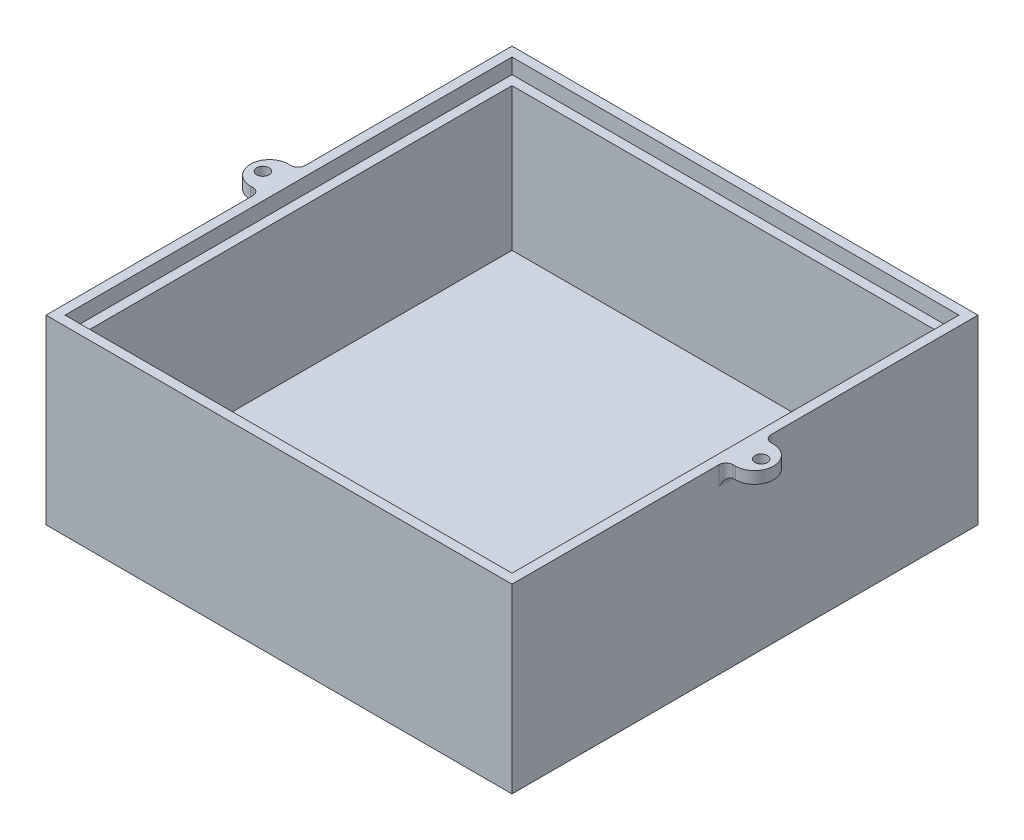
ISO-10303-21;
HEADER;
FILE_DESCRIPTION(('STEP AP214'),'2;1');
FILE_NAME('part.step','',(''),(''),'','','');
FILE_SCHEMA(('AUTOMOTIVE_DESIGN { 1 0 10303 214 1 1 1 1 }'));
ENDSEC;
DATA;
#1=APPLICATION_CONTEXT('core data for automotive mechanical design processes');
#2=APPLICATION_PROTOCOL_DEFINITION('international standard','automotive_design',2000,#1);
#3=PRODUCT_CONTEXT('',#1,'mechanical');
#4=PRODUCT('Part','Part','',(#3));
#5=PRODUCT_RELATED_PRODUCT_CATEGORY('part','',(#4));
#6=PRODUCT_DEFINITION_FORMATION('','',#4);
#7=PRODUCT_DEFINITION_CONTEXT('part definition',#1,'design');
#8=PRODUCT_DEFINITION('design','',#6,#7);
#9=PRODUCT_DEFINITION_SHAPE('','',#8);
#10=(LENGTH_UNIT() NAMED_UNIT(*) SI_UNIT(.MILLI.,.METRE.));
#11=(NAMED_UNIT(*) PLANE_ANGLE_UNIT() SI_UNIT($,.RADIAN.));
#12=(NAMED_UNIT(*) SI_UNIT($,.STERADIAN.) SOLID_ANGLE_UNIT());
#13=UNCERTAINTY_MEASURE_WITH_UNIT(LENGTH_MEASURE(1.E-05),#10,'distance_accuracy_value','');
#14=(GEOMETRIC_REPRESENTATION_CONTEXT(3) GLOBAL_UNCERTAINTY_ASSIGNED_CONTEXT((#13)) GLOBAL_UNIT_ASSIGNED_CONTEXT((#10,
#11,#12)) REPRESENTATION_CONTEXT('',''));
#15=CARTESIAN_POINT('',(0.,0.,0.));
#16=DIRECTION('',(0.,0.,1.));
#17=DIRECTION('',(1.,0.,0.));
#18=AXIS2_PLACEMENT_3D('',#15,#16,#17);
#19=CARTESIAN_POINT('',(49.,40.,-49.));
#20=DIRECTION('',(-1.,0.,0.));
#21=DIRECTION('',(0.,0.,1.));
#22=AXIS2_PLACEMENT_3D('',#19,#20,#21);
#23=PLANE('',#22);
#24=DIRECTION('',(0.,0.,-1.));
#25=VECTOR('',#24,1.);
#26=CARTESIAN_POINT('',(49.,38.2,-49.));
#27=LINE('',#26,#25);
#28=CARTESIAN_POINT('',(49.,38.2,-5.50000000000001));
#29=VERTEX_POINT('',#28);
#30=CARTESIAN_POINT('',(49.,38.2,-49.));
#31=VERTEX_POINT('',#30);
#32=EDGE_CURVE('E300',#29,#31,#27,.T.);
#33=ORIENTED_EDGE('',*,*,#32,.F.);
#34=DIRECTION('',(0.,1.,0.));
#35=VECTOR('',#34,1.);
#36=CARTESIAN_POINT('',(49.,40.,-5.50000000000001));
#37=LINE('',#36,#35);
#38=CARTESIAN_POINT('',(49.,34.2,-5.5));
#39=VERTEX_POINT('',#38);
#40=EDGE_CURVE('E455',#29,#39,#37,.F.);
#41=ORIENTED_EDGE('',*,*,#40,.T.);
#42=DIRECTION('',(0.,0.,1.));
#43=VECTOR('',#42,1.);
#44=CARTESIAN_POINT('',(49.,34.2,-49.));
#45=LINE('',#44,#43);
#46=CARTESIAN_POINT('',(49.,34.2,5.5));
#47=VERTEX_POINT('',#46);
#48=EDGE_CURVE('E452',#39,#47,#45,.T.);
#49=ORIENTED_EDGE('',*,*,#48,.T.);
#50=DIRECTION('',(0.,1.,0.));
#51=VECTOR('',#50,1.);
#52=CARTESIAN_POINT('',(49.,40.,5.5));
#53=LINE('',#52,#51);
#54=CARTESIAN_POINT('',(49.,38.2,5.5));
#55=VERTEX_POINT('',#54);
#56=EDGE_CURVE('E449',#47,#55,#53,.T.);
#57=ORIENTED_EDGE('',*,*,#56,.T.);
#58=CARTESIAN_POINT('',(49.,38.2,49.));
#59=VERTEX_POINT('',#58);
#60=EDGE_CURVE('E301',#59,#55,#27,.T.);
#61=ORIENTED_EDGE('',*,*,#60,.F.);
#62=DIRECTION('',(0.,-1.,0.));
#63=VECTOR('',#62,1.);
#64=CARTESIAN_POINT('',(49.,40.,49.));
#65=LINE('',#64,#63);
#66=CARTESIAN_POINT('',(49.,0.,49.));
#67=VERTEX_POINT('',#66);
#68=EDGE_CURVE('E399',#59,#67,#65,.T.);
#69=ORIENTED_EDGE('',*,*,#68,.T.);
#70=DIRECTION('',(0.,0.,-1.));
#71=VECTOR('',#70,1.);
#72=CARTESIAN_POINT('',(49.,0.,-49.));
#73=LINE('',#72,#71);
#74=CARTESIAN_POINT('',(49.,0.,-49.));
#75=VERTEX_POINT('',#74);
#76=EDGE_CURVE('E372',#67,#75,#73,.T.);
#77=ORIENTED_EDGE('',*,*,#76,.T.);
#78=DIRECTION('',(0.,-1.,0.));
#79=VECTOR('',#78,1.);
#80=CARTESIAN_POINT('',(49.,40.,-49.));
#81=LINE('',#80,#79);
#82=EDGE_CURVE('E408',#31,#75,#81,.T.);
#83=ORIENTED_EDGE('',*,*,#82,.F.);
#84=EDGE_LOOP('',(#33,#41,#49,#57,#61,#69,#77,#83));
#85=FACE_BOUND('',#84,.T.);
#86=ADVANCED_FACE('F39',(#85),#23,.F.);
#87=CARTESIAN_POINT('',(-49.,40.,-49.));
#88=DIRECTION('',(1.,0.,0.));
#89=DIRECTION('',(0.,0.,-1.));
#90=AXIS2_PLACEMENT_3D('',#87,#88,#89);
#91=PLANE('',#90);
#92=DIRECTION('',(0.,0.,-1.));
#93=VECTOR('',#92,1.);
#94=CARTESIAN_POINT('',(-49.,34.2,-4.));
#95=LINE('',#94,#93);
#96=CARTESIAN_POINT('',(-49.,34.2,5.5));
#97=VERTEX_POINT('',#96);
#98=CARTESIAN_POINT('',(-49.,34.2,-5.50000000000001));
#99=VERTEX_POINT('',#98);
#100=EDGE_CURVE('E414',#97,#99,#95,.T.);
#101=ORIENTED_EDGE('',*,*,#100,.T.);
#102=DIRECTION('',(0.,1.,0.));
#103=VECTOR('',#102,1.);
#104=CARTESIAN_POINT('',(-49.,40.,-5.50000000000001));
#105=LINE('',#104,#103);
#106=CARTESIAN_POINT('',(-49.,38.2,-5.50000000000001));
#107=VERTEX_POINT('',#106);
#108=EDGE_CURVE('E417',#99,#107,#105,.T.);
#109=ORIENTED_EDGE('',*,*,#108,.T.);
#110=DIRECTION('',(0.,0.,1.));
#111=VECTOR('',#110,1.);
#112=CARTESIAN_POINT('',(-49.,38.2,-49.));
#113=LINE('',#112,#111);
#114=CARTESIAN_POINT('',(-49.,38.2,-49.));
#115=VERTEX_POINT('',#114);
#116=EDGE_CURVE('E293',#115,#107,#113,.T.);
#117=ORIENTED_EDGE('',*,*,#116,.F.);
#118=DIRECTION('',(0.,-1.,0.));
#119=VECTOR('',#118,1.);
#120=CARTESIAN_POINT('',(-49.,40.,-49.));
#121=LINE('',#120,#119);
#122=CARTESIAN_POINT('',(-49.,0.,-49.));
#123=VERTEX_POINT('',#122);
#124=EDGE_CURVE('E405',#115,#123,#121,.T.);
#125=ORIENTED_EDGE('',*,*,#124,.T.);
#126=DIRECTION('',(0.,0.,1.));
#127=VECTOR('',#126,1.);
#128=CARTESIAN_POINT('',(-49.,0.,-49.));
#129=LINE('',#128,#127);
#130=CARTESIAN_POINT('',(-49.,0.,49.));
#131=VERTEX_POINT('',#130);
#132=EDGE_CURVE('E391',#123,#131,#129,.T.);
#133=ORIENTED_EDGE('',*,*,#132,.T.);
#134=DIRECTION('',(0.,-1.,0.));
#135=VECTOR('',#134,1.);
#136=CARTESIAN_POINT('',(-49.,40.,49.));
#137=LINE('',#136,#135);
#138=CARTESIAN_POINT('',(-49.,38.2,49.));
#139=VERTEX_POINT('',#138);
#140=EDGE_CURVE('E402',#139,#131,#137,.T.);
#141=ORIENTED_EDGE('',*,*,#140,.F.);
#142=CARTESIAN_POINT('',(-49.,38.2,5.5));
#143=VERTEX_POINT('',#142);
#144=EDGE_CURVE('E292',#143,#139,#113,.T.);
#145=ORIENTED_EDGE('',*,*,#144,.F.);
#146=DIRECTION('',(0.,1.,0.));
#147=VECTOR('',#146,1.);
#148=CARTESIAN_POINT('',(-49.,40.,5.5));
#149=LINE('',#148,#147);
#150=EDGE_CURVE('E411',#143,#97,#149,.F.);
#151=ORIENTED_EDGE('',*,*,#150,.T.);
#152=EDGE_LOOP('',(#101,#109,#117,#125,#133,#141,#145,#151));
#153=FACE_BOUND('',#152,.T.);
#154=ADVANCED_FACE('F491',(#153),#91,.F.);
#155=CARTESIAN_POINT('',(47.,35.,-47.));
#156=DIRECTION('',(1.,0.,0.));
#157=DIRECTION('',(0.,0.,-1.));
#158=AXIS2_PLACEMENT_3D('',#155,#156,#157);
#159=PLANE('',#158);
#160=DIRECTION('',(0.,0.,-1.));
#161=VECTOR('',#160,1.);
#162=CARTESIAN_POINT('',(47.,38.2,-47.));
#163=LINE('',#162,#161);
#164=CARTESIAN_POINT('',(47.,38.2,47.));
#165=VERTEX_POINT('',#164);
#166=CARTESIAN_POINT('',(47.,38.2,-47.));
#167=VERTEX_POINT('',#166);
#168=EDGE_CURVE('E284',#165,#167,#163,.T.);
#169=ORIENTED_EDGE('',*,*,#168,.T.);
#170=DIRECTION('',(0.,1.,0.));
#171=VECTOR('',#170,1.);
#172=CARTESIAN_POINT('',(47.,35.,-47.));
#173=LINE('',#172,#171);
#174=CARTESIAN_POINT('',(47.,35.,-47.));
#175=VERTEX_POINT('',#174);
#176=EDGE_CURVE('E367',#175,#167,#173,.T.);
#177=ORIENTED_EDGE('',*,*,#176,.F.);
#178=DIRECTION('',(0.,0.,-1.));
#179=VECTOR('',#178,1.);
#180=CARTESIAN_POINT('',(47.,35.,-47.));
#181=LINE('',#180,#179);
#182=CARTESIAN_POINT('',(47.,35.,47.));
#183=VERTEX_POINT('',#182);
#184=EDGE_CURVE('E342',#183,#175,#181,.T.);
#185=ORIENTED_EDGE('',*,*,#184,.F.);
#186=DIRECTION('',(0.,1.,0.));
#187=VECTOR('',#186,1.);
#188=CARTESIAN_POINT('',(47.,35.,47.));
#189=LINE('',#188,#187);
#190=EDGE_CURVE('E368',#183,#165,#189,.T.);
#191=ORIENTED_EDGE('',*,*,#190,.T.);
#192=EDGE_LOOP('',(#169,#177,#185,#191));
#193=FACE_BOUND('',#192,.T.);
#194=ADVANCED_FACE('F552',(#193),#159,.F.);
#195=CARTESIAN_POINT('',(-47.,35.,47.));
#196=DIRECTION('',(0.,0.,1.));
#197=DIRECTION('',(1.,0.,0.));
#198=AXIS2_PLACEMENT_3D('',#195,#196,#197);
#199=PLANE('',#198);
#200=DIRECTION('',(1.,0.,0.));
#201=VECTOR('',#200,1.);
#202=CARTESIAN_POINT('',(-47.,38.2,47.));
#203=LINE('',#202,#201);
#204=CARTESIAN_POINT('',(-47.,38.2,47.));
#205=VERTEX_POINT('',#204);
#206=EDGE_CURVE('E280',#205,#165,#203,.T.);
#207=ORIENTED_EDGE('',*,*,#206,.T.);
#208=ORIENTED_EDGE('',*,*,#190,.F.);
#209=DIRECTION('',(1.,0.,0.));
#210=VECTOR('',#209,1.);
#211=CARTESIAN_POINT('',(-47.,35.,47.));
#212=LINE('',#211,#210);
#213=CARTESIAN_POINT('',(-47.,35.,47.));
#214=VERTEX_POINT('',#213);
#215=EDGE_CURVE('E363',#214,#183,#212,.T.);
#216=ORIENTED_EDGE('',*,*,#215,.F.);
#217=DIRECTION('',(0.,1.,0.));
#218=VECTOR('',#217,1.);
#219=CARTESIAN_POINT('',(-47.,35.,47.));
#220=LINE('',#219,#218);
#221=EDGE_CURVE('E373',#214,#205,#220,.T.);
#222=ORIENTED_EDGE('',*,*,#221,.T.);
#223=EDGE_LOOP('',(#207,#208,#216,#222));
#224=FACE_BOUND('',#223,.T.);
#225=ADVANCED_FACE('F675',(#224),#199,.F.);
#226=CARTESIAN_POINT('',(-47.,35.,-47.));
#227=DIRECTION('',(-1.,0.,0.));
#228=DIRECTION('',(0.,0.,1.));
#229=AXIS2_PLACEMENT_3D('',#226,#227,#228);
#230=PLANE('',#229);
#231=DIRECTION('',(0.,0.,1.));
#232=VECTOR('',#231,1.);
#233=CARTESIAN_POINT('',(-47.,38.2,-47.));
#234=LINE('',#233,#232);
#235=CARTESIAN_POINT('',(-47.,38.2,-47.));
#236=VERTEX_POINT('',#235);
#237=EDGE_CURVE('E273',#236,#205,#234,.T.);
#238=ORIENTED_EDGE('',*,*,#237,.T.);
#239=ORIENTED_EDGE('',*,*,#221,.F.);
#240=DIRECTION('',(0.,0.,1.));
#241=VECTOR('',#240,1.);
#242=CARTESIAN_POINT('',(-47.,35.,-47.));
#243=LINE('',#242,#241);
#244=CARTESIAN_POINT('',(-47.,35.,-47.));
#245=VERTEX_POINT('',#244);
#246=EDGE_CURVE('E359',#245,#214,#243,.T.);
#247=ORIENTED_EDGE('',*,*,#246,.F.);
#248=DIRECTION('',(0.,1.,0.));
#249=VECTOR('',#248,1.);
#250=CARTESIAN_POINT('',(-47.,35.,-47.));
#251=LINE('',#250,#249);
#252=EDGE_CURVE('E377',#245,#236,#251,.T.);
#253=ORIENTED_EDGE('',*,*,#252,.T.);
#254=EDGE_LOOP('',(#238,#239,#247,#253));
#255=FACE_BOUND('',#254,.T.);
#256=ADVANCED_FACE('F663',(#255),#230,.F.);
#257=CARTESIAN_POINT('',(-47.,35.,-47.));
#258=DIRECTION('',(0.,0.,-1.));
#259=DIRECTION('',(-1.,0.,0.));
#260=AXIS2_PLACEMENT_3D('',#257,#258,#259);
#261=PLANE('',#260);
#262=DIRECTION('',(-1.,0.,0.));
#263=VECTOR('',#262,1.);
#264=CARTESIAN_POINT('',(-47.,38.2,-47.));
#265=LINE('',#264,#263);
#266=EDGE_CURVE('E288',#167,#236,#265,.T.);
#267=ORIENTED_EDGE('',*,*,#266,.T.);
#268=ORIENTED_EDGE('',*,*,#252,.F.);
#269=DIRECTION('',(-1.,0.,0.));
#270=VECTOR('',#269,1.);
#271=CARTESIAN_POINT('',(-47.,35.,-47.));
#272=LINE('',#271,#270);
#273=EDGE_CURVE('E355',#175,#245,#272,.T.);
#274=ORIENTED_EDGE('',*,*,#273,.F.);
#275=ORIENTED_EDGE('',*,*,#176,.T.);
#276=EDGE_LOOP('',(#267,#268,#274,#275));
#277=FACE_BOUND('',#276,.T.);
#278=ADVANCED_FACE('F657',(#277),#261,.F.);
#279=CARTESIAN_POINT('',(0.,35.,0.));
#280=DIRECTION('',(0.,1.,0.));
#281=DIRECTION('',(0.,0.,1.));
#282=AXIS2_PLACEMENT_3D('',#279,#280,#281);
#283=PLANE('',#282);
#284=DIRECTION('',(0.,0.,-1.));
#285=VECTOR('',#284,1.);
#286=CARTESIAN_POINT('',(45.,35.,-45.));
#287=LINE('',#286,#285);
#288=CARTESIAN_POINT('',(45.,35.,45.));
#289=VERTEX_POINT('',#288);
#290=CARTESIAN_POINT('',(45.,35.,-45.));
#291=VERTEX_POINT('',#290);
#292=EDGE_CURVE('E307',#289,#291,#287,.T.);
#293=ORIENTED_EDGE('',*,*,#292,.F.);
#294=DIRECTION('',(1.,0.,0.));
#295=VECTOR('',#294,1.);
#296=CARTESIAN_POINT('',(-45.,35.,45.));
#297=LINE('',#296,#295);
#298=CARTESIAN_POINT('',(-45.,35.,45.));
#299=VERTEX_POINT('',#298);
#300=EDGE_CURVE('E313',#299,#289,#297,.T.);
#301=ORIENTED_EDGE('',*,*,#300,.F.);
#302=DIRECTION('',(0.,0.,1.));
#303=VECTOR('',#302,1.);
#304=CARTESIAN_POINT('',(-45.,35.,-45.));
#305=LINE('',#304,#303);
#306=CARTESIAN_POINT('',(-45.,35.,-45.));
#307=VERTEX_POINT('',#306);
#308=EDGE_CURVE('E333',#307,#299,#305,.T.);
#309=ORIENTED_EDGE('',*,*,#308,.F.);
#310=DIRECTION('',(-1.,0.,0.));
#311=VECTOR('',#310,1.);
#312=CARTESIAN_POINT('',(-45.,35.,-45.));
#313=LINE('',#312,#311);
#314=EDGE_CURVE('E329',#291,#307,#313,.T.);
#315=ORIENTED_EDGE('',*,*,#314,.F.);
#316=EDGE_LOOP('',(#293,#301,#309,#315));
#317=FACE_BOUND('',#316,.T.);
#318=ORIENTED_EDGE('',*,*,#184,.T.);
#319=ORIENTED_EDGE('',*,*,#273,.T.);
#320=ORIENTED_EDGE('',*,*,#246,.T.);
#321=ORIENTED_EDGE('',*,*,#215,.T.);
#322=EDGE_LOOP('',(#318,#319,#320,#321));
#323=FACE_BOUND('',#322,.T.);
#324=ADVANCED_FACE('F662',(#317,#323),#283,.T.);
#325=CARTESIAN_POINT('',(45.,5.,-45.));
#326=DIRECTION('',(1.,0.,0.));
#327=DIRECTION('',(0.,0.,-1.));
#328=AXIS2_PLACEMENT_3D('',#325,#326,#327);
#329=PLANE('',#328);
#330=ORIENTED_EDGE('',*,*,#292,.T.);
#331=DIRECTION('',(0.,1.,0.));
#332=VECTOR('',#331,1.);
#333=CARTESIAN_POINT('',(45.,5.,-45.));
#334=LINE('',#333,#332);
#335=CARTESIAN_POINT('',(45.,5.,-45.));
#336=VERTEX_POINT('',#335);
#337=EDGE_CURVE('E325',#336,#291,#334,.T.);
#338=ORIENTED_EDGE('',*,*,#337,.F.);
#339=DIRECTION('',(0.,0.,-1.));
#340=VECTOR('',#339,1.);
#341=CARTESIAN_POINT('',(45.,5.,-45.));
#342=LINE('',#341,#340);
#343=CARTESIAN_POINT('',(45.,5.,45.));
#344=VERTEX_POINT('',#343);
#345=EDGE_CURVE('E308',#344,#336,#342,.T.);
#346=ORIENTED_EDGE('',*,*,#345,.F.);
#347=DIRECTION('',(0.,1.,0.));
#348=VECTOR('',#347,1.);
#349=CARTESIAN_POINT('',(45.,5.,45.));
#350=LINE('',#349,#348);
#351=EDGE_CURVE('E339',#344,#289,#350,.T.);
#352=ORIENTED_EDGE('',*,*,#351,.T.);
#353=EDGE_LOOP('',(#330,#338,#346,#352));
#354=FACE_BOUND('',#353,.T.);
#355=ADVANCED_FACE('F733',(#354),#329,.F.);
#356=CARTESIAN_POINT('',(-45.,5.,45.));
#357=DIRECTION('',(0.,0.,1.));
#358=DIRECTION('',(1.,0.,0.));
#359=AXIS2_PLACEMENT_3D('',#356,#357,#358);
#360=PLANE('',#359);
#361=ORIENTED_EDGE('',*,*,#300,.T.);
#362=ORIENTED_EDGE('',*,*,#351,.F.);
#363=DIRECTION('',(1.,0.,0.));
#364=VECTOR('',#363,1.);
#365=CARTESIAN_POINT('',(-45.,5.,45.));
#366=LINE('',#365,#364);
#367=CARTESIAN_POINT('',(-45.,5.,45.));
#368=VERTEX_POINT('',#367);
#369=EDGE_CURVE('E321',#368,#344,#366,.T.);
#370=ORIENTED_EDGE('',*,*,#369,.F.);
#371=DIRECTION('',(0.,1.,0.));
#372=VECTOR('',#371,1.);
#373=CARTESIAN_POINT('',(-45.,5.,45.));
#374=LINE('',#373,#372);
#375=EDGE_CURVE('E343',#368,#299,#374,.T.);
#376=ORIENTED_EDGE('',*,*,#375,.T.);
#377=EDGE_LOOP('',(#361,#362,#370,#376));
#378=FACE_BOUND('',#377,.T.);
#379=ADVANCED_FACE('F723',(#378),#360,.F.);
#380=CARTESIAN_POINT('',(-45.,5.,-45.));
#381=DIRECTION('',(-1.,0.,0.));
#382=DIRECTION('',(0.,0.,1.));
#383=AXIS2_PLACEMENT_3D('',#380,#381,#382);
#384=PLANE('',#383);
#385=ORIENTED_EDGE('',*,*,#308,.T.);
#386=ORIENTED_EDGE('',*,*,#375,.F.);
#387=DIRECTION('',(0.,0.,1.));
#388=VECTOR('',#387,1.);
#389=CARTESIAN_POINT('',(-45.,5.,-45.));
#390=LINE('',#389,#388);
#391=CARTESIAN_POINT('',(-45.,5.,-45.));
#392=VERTEX_POINT('',#391);
#393=EDGE_CURVE('E317',#392,#368,#390,.T.);
#394=ORIENTED_EDGE('',*,*,#393,.F.);
#395=DIRECTION('',(0.,1.,0.));
#396=VECTOR('',#395,1.);
#397=CARTESIAN_POINT('',(-45.,5.,-45.));
#398=LINE('',#397,#396);
#399=EDGE_CURVE('E347',#392,#307,#398,.T.);
#400=ORIENTED_EDGE('',*,*,#399,.T.);
#401=EDGE_LOOP('',(#385,#386,#394,#400));
#402=FACE_BOUND('',#401,.T.);
#403=ADVANCED_FACE('F713',(#402),#384,.F.);
#404=CARTESIAN_POINT('',(-45.,5.,-45.));
#405=DIRECTION('',(0.,0.,-1.));
#406=DIRECTION('',(-1.,0.,0.));
#407=AXIS2_PLACEMENT_3D('',#404,#405,#406);
#408=PLANE('',#407);
#409=ORIENTED_EDGE('',*,*,#314,.T.);
#410=ORIENTED_EDGE('',*,*,#399,.F.);
#411=DIRECTION('',(-1.,0.,0.));
#412=VECTOR('',#411,1.);
#413=CARTESIAN_POINT('',(-45.,5.,-45.));
#414=LINE('',#413,#412);
#415=EDGE_CURVE('E312',#336,#392,#414,.T.);
#416=ORIENTED_EDGE('',*,*,#415,.F.);
#417=ORIENTED_EDGE('',*,*,#337,.T.);
#418=EDGE_LOOP('',(#409,#410,#416,#417));
#419=FACE_BOUND('',#418,.T.);
#420=ADVANCED_FACE('F702',(#419),#408,.F.);
#421=CARTESIAN_POINT('',(0.,5.,0.));
#422=DIRECTION('',(0.,1.,0.));
#423=DIRECTION('',(0.,0.,1.));
#424=AXIS2_PLACEMENT_3D('',#421,#422,#423);
#425=PLANE('',#424);
#426=ORIENTED_EDGE('',*,*,#345,.T.);
#427=ORIENTED_EDGE('',*,*,#415,.T.);
#428=ORIENTED_EDGE('',*,*,#393,.T.);
#429=ORIENTED_EDGE('',*,*,#369,.T.);
#430=EDGE_LOOP('',(#426,#427,#428,#429));
#431=FACE_BOUND('',#430,.T.);
#432=ADVANCED_FACE('F698',(#431),#425,.T.);
#433=CARTESIAN_POINT('',(0.,38.2,0.));
#434=DIRECTION('',(0.,1.,0.));
#435=DIRECTION('',(0.,0.,1.));
#436=AXIS2_PLACEMENT_3D('',#433,#434,#435);
#437=PLANE('',#436);
#438=ORIENTED_EDGE('',*,*,#266,.F.);
#439=ORIENTED_EDGE('',*,*,#168,.F.);
#440=ORIENTED_EDGE('',*,*,#206,.F.);
#441=ORIENTED_EDGE('',*,*,#237,.F.);
#442=EDGE_LOOP('',(#438,#439,#440,#441));
#443=FACE_BOUND('',#442,.T.);
#444=ORIENTED_EDGE('',*,*,#116,.T.);
#445=CARTESIAN_POINT('',(-50.5,38.2,-5.50000000000001));
#446=DIRECTION('',(0.,1.,0.));
#447=DIRECTION('',(0.,0.,1.));
#448=AXIS2_PLACEMENT_3D('',#445,#446,#447);
#449=CIRCLE('',#448,1.5);
#450=CARTESIAN_POINT('',(-50.5,38.2,-4.));
#451=VERTEX_POINT('',#450);
#452=EDGE_CURVE('E430',#107,#451,#449,.F.);
#453=ORIENTED_EDGE('',*,*,#452,.T.);
#454=DIRECTION('',(-1.,0.,0.));
#455=VECTOR('',#454,1.);
#456=CARTESIAN_POINT('',(-49.,38.2,-4.));
#457=LINE('',#456,#455);
#458=CARTESIAN_POINT('',(-51.,38.2,-4.));
#459=VERTEX_POINT('',#458);
#460=EDGE_CURVE('E244',#451,#459,#457,.T.);
#461=ORIENTED_EDGE('',*,*,#460,.T.);
#462=CARTESIAN_POINT('',(-51.,38.2,0.));
#463=DIRECTION('',(0.,1.,0.));
#464=DIRECTION('',(0.,0.,1.));
#465=AXIS2_PLACEMENT_3D('',#462,#463,#464);
#466=CIRCLE('',#465,4.);
#467=CARTESIAN_POINT('',(-51.,38.2,4.));
#468=VERTEX_POINT('',#467);
#469=EDGE_CURVE('E263',#459,#468,#466,.T.);
#470=ORIENTED_EDGE('',*,*,#469,.T.);
#471=DIRECTION('',(1.,0.,0.));
#472=VECTOR('',#471,1.);
#473=CARTESIAN_POINT('',(-49.,38.2,4.));
#474=LINE('',#473,#472);
#475=CARTESIAN_POINT('',(-50.5,38.2,4.));
#476=VERTEX_POINT('',#475);
#477=EDGE_CURVE('E252',#468,#476,#474,.T.);
#478=ORIENTED_EDGE('',*,*,#477,.T.);
#479=CARTESIAN_POINT('',(-50.5,38.2,5.5));
#480=DIRECTION('',(0.,1.,0.));
#481=DIRECTION('',(0.,0.,1.));
#482=AXIS2_PLACEMENT_3D('',#479,#480,#481);
#483=CIRCLE('',#482,1.5);
#484=EDGE_CURVE('E433',#476,#143,#483,.F.);
#485=ORIENTED_EDGE('',*,*,#484,.T.);
#486=ORIENTED_EDGE('',*,*,#144,.T.);
#487=DIRECTION('',(1.,0.,0.));
#488=VECTOR('',#487,1.);
#489=CARTESIAN_POINT('',(-49.,38.2,49.));
#490=LINE('',#489,#488);
#491=EDGE_CURVE('E297',#139,#59,#490,.T.);
#492=ORIENTED_EDGE('',*,*,#491,.T.);
#493=ORIENTED_EDGE('',*,*,#60,.T.);
#494=CARTESIAN_POINT('',(50.5,38.2,5.5));
#495=DIRECTION('',(0.,1.,0.));
#496=DIRECTION('',(0.,0.,1.));
#497=AXIS2_PLACEMENT_3D('',#494,#495,#496);
#498=CIRCLE('',#497,1.5);
#499=CARTESIAN_POINT('',(50.5,38.2,4.));
#500=VERTEX_POINT('',#499);
#501=EDGE_CURVE('E11',#55,#500,#498,.F.);
#502=ORIENTED_EDGE('',*,*,#501,.T.);
#503=DIRECTION('',(1.,0.,0.));
#504=VECTOR('',#503,1.);
#505=CARTESIAN_POINT('',(49.,38.2,4.));
#506=LINE('',#505,#504);
#507=CARTESIAN_POINT('',(51.,38.2,4.));
#508=VERTEX_POINT('',#507);
#509=EDGE_CURVE('E231',#500,#508,#506,.T.);
#510=ORIENTED_EDGE('',*,*,#509,.T.);
#511=CARTESIAN_POINT('',(51.,38.2,0.));
#512=DIRECTION('',(0.,1.,0.));
#513=DIRECTION('',(0.,0.,-1.));
#514=AXIS2_PLACEMENT_3D('',#511,#512,#513);
#515=CIRCLE('',#514,4.);
#516=CARTESIAN_POINT('',(51.,38.2,-4.));
#517=VERTEX_POINT('',#516);
#518=EDGE_CURVE('E216',#508,#517,#515,.T.);
#519=ORIENTED_EDGE('',*,*,#518,.T.);
#520=DIRECTION('',(-1.,0.,0.));
#521=VECTOR('',#520,1.);
#522=CARTESIAN_POINT('',(49.,38.2,-4.));
#523=LINE('',#522,#521);
#524=CARTESIAN_POINT('',(50.5,38.2,-4.));
#525=VERTEX_POINT('',#524);
#526=EDGE_CURVE('E227',#517,#525,#523,.T.);
#527=ORIENTED_EDGE('',*,*,#526,.T.);
#528=CARTESIAN_POINT('',(50.5,38.2,-5.5));
#529=DIRECTION('',(0.,1.,0.));
#530=DIRECTION('',(0.,0.,1.));
#531=AXIS2_PLACEMENT_3D('',#528,#529,#530);
#532=CIRCLE('',#531,1.5);
#533=EDGE_CURVE('E49',#525,#29,#532,.F.);
#534=ORIENTED_EDGE('',*,*,#533,.T.);
#535=ORIENTED_EDGE('',*,*,#32,.T.);
#536=DIRECTION('',(-1.,0.,0.));
#537=VECTOR('',#536,1.);
#538=CARTESIAN_POINT('',(-49.,38.2,-49.));
#539=LINE('',#538,#537);
#540=EDGE_CURVE('E304',#31,#115,#539,.T.);
#541=ORIENTED_EDGE('',*,*,#540,.T.);
#542=EDGE_LOOP('',(#444,#453,#461,#470,#478,#485,#486,#492,#493,#502,#510,#519,#527,#534,#535,#541));
#543=FACE_BOUND('',#542,.T.);
#544=CARTESIAN_POINT('',(-52.4,38.2,0.));
#545=DIRECTION('',(0.,1.,0.));
#546=DIRECTION('',(0.,0.,1.));
#547=AXIS2_PLACEMENT_3D('',#544,#545,#546);
#548=CIRCLE('',#547,1.3);
#549=CARTESIAN_POINT('',(-52.4,38.2,1.3));
#550=VERTEX_POINT('',#549);
#551=EDGE_CURVE('E238',#550,#550,#548,.T.);
#552=ORIENTED_EDGE('',*,*,#551,.F.);
#553=EDGE_LOOP('',(#552));
#554=FACE_BOUND('',#553,.T.);
#555=CARTESIAN_POINT('',(52.4,38.2,0.));
#556=DIRECTION('',(0.,1.,0.));
#557=DIRECTION('',(0.,0.,-1.));
#558=AXIS2_PLACEMENT_3D('',#555,#556,#557);
#559=CIRCLE('',#558,1.3);
#560=CARTESIAN_POINT('',(52.4,38.2,-1.30000000000001));
#561=VERTEX_POINT('',#560);
#562=EDGE_CURVE('E445',#561,#561,#559,.T.);
#563=ORIENTED_EDGE('',*,*,#562,.F.);
#564=EDGE_LOOP('',(#563));
#565=FACE_BOUND('',#564,.T.);
#566=ADVANCED_FACE('F483',(#443,#543,#554,#565),#437,.T.);
#567=CARTESIAN_POINT('',(0.,0.,0.));
#568=DIRECTION('',(0.,1.,0.));
#569=DIRECTION('',(0.,0.,1.));
#570=AXIS2_PLACEMENT_3D('',#567,#568,#569);
#571=PLANE('',#570);
#572=ORIENTED_EDGE('',*,*,#76,.F.);
#573=DIRECTION('',(1.,0.,0.));
#574=VECTOR('',#573,1.);
#575=CARTESIAN_POINT('',(-49.,0.,49.));
#576=LINE('',#575,#574);
#577=EDGE_CURVE('E395',#131,#67,#576,.T.);
#578=ORIENTED_EDGE('',*,*,#577,.F.);
#579=ORIENTED_EDGE('',*,*,#132,.F.);
#580=DIRECTION('',(-1.,0.,0.));
#581=VECTOR('',#580,1.);
#582=CARTESIAN_POINT('',(-49.,0.,-49.));
#583=LINE('',#582,#581);
#584=EDGE_CURVE('E387',#75,#123,#583,.T.);
#585=ORIENTED_EDGE('',*,*,#584,.F.);
#586=EDGE_LOOP('',(#572,#578,#579,#585));
#587=FACE_BOUND('',#586,.T.);
#588=ADVANCED_FACE('F500',(#587),#571,.F.);
#589=CARTESIAN_POINT('',(-49.,40.,49.));
#590=DIRECTION('',(0.,0.,-1.));
#591=DIRECTION('',(-1.,0.,0.));
#592=AXIS2_PLACEMENT_3D('',#589,#590,#591);
#593=PLANE('',#592);
#594=ORIENTED_EDGE('',*,*,#491,.F.);
#595=ORIENTED_EDGE('',*,*,#140,.T.);
#596=ORIENTED_EDGE('',*,*,#577,.T.);
#597=ORIENTED_EDGE('',*,*,#68,.F.);
#598=EDGE_LOOP('',(#594,#595,#596,#597));
#599=FACE_BOUND('',#598,.T.);
#600=ADVANCED_FACE('F489',(#599),#593,.F.);
#601=CARTESIAN_POINT('',(-49.,40.,-49.));
#602=DIRECTION('',(0.,0.,1.));
#603=DIRECTION('',(1.,0.,0.));
#604=AXIS2_PLACEMENT_3D('',#601,#602,#603);
#605=PLANE('',#604);
#606=ORIENTED_EDGE('',*,*,#540,.F.);
#607=ORIENTED_EDGE('',*,*,#82,.T.);
#608=ORIENTED_EDGE('',*,*,#584,.T.);
#609=ORIENTED_EDGE('',*,*,#124,.F.);
#610=EDGE_LOOP('',(#606,#607,#608,#609));
#611=FACE_BOUND('',#610,.T.);
#612=ADVANCED_FACE('F504',(#611),#605,.F.);
#613=CARTESIAN_POINT('',(-49.,35.7,4.));
#614=DIRECTION('',(0.,0.,1.));
#615=DIRECTION('',(1.,0.,0.));
#616=AXIS2_PLACEMENT_3D('',#613,#614,#615);
#617=PLANE('',#616);
#618=DIRECTION('',(1.,0.,0.));
#619=VECTOR('',#618,1.);
#620=CARTESIAN_POINT('',(-49.,35.7,4.));
#621=LINE('',#620,#619);
#622=CARTESIAN_POINT('',(-51.,35.7,4.));
#623=VERTEX_POINT('',#622);
#624=CARTESIAN_POINT('',(-50.5,35.7,4.));
#625=VERTEX_POINT('',#624);
#626=EDGE_CURVE('E256',#623,#625,#621,.T.);
#627=ORIENTED_EDGE('',*,*,#626,.T.);
#628=DIRECTION('',(0.,1.,0.));
#629=VECTOR('',#628,1.);
#630=CARTESIAN_POINT('',(-50.5,35.7,4.));
#631=LINE('',#630,#629);
#632=EDGE_CURVE('E427',#625,#476,#631,.T.);
#633=ORIENTED_EDGE('',*,*,#632,.T.);
#634=ORIENTED_EDGE('',*,*,#477,.F.);
#635=DIRECTION('',(0.,1.,0.));
#636=VECTOR('',#635,1.);
#637=CARTESIAN_POINT('',(-51.,35.7,4.));
#638=LINE('',#637,#636);
#639=EDGE_CURVE('E270',#623,#468,#638,.T.);
#640=ORIENTED_EDGE('',*,*,#639,.F.);
#641=EDGE_LOOP('',(#627,#633,#634,#640));
#642=FACE_BOUND('',#641,.T.);
#643=ADVANCED_FACE('F523',(#642),#617,.T.);
#644=CARTESIAN_POINT('',(-51.,35.7,0.));
#645=DIRECTION('',(0.,1.,0.));
#646=DIRECTION('',(0.,0.,1.));
#647=AXIS2_PLACEMENT_3D('',#644,#645,#646);
#648=CYLINDRICAL_SURFACE('',#647,4.);
#649=ORIENTED_EDGE('',*,*,#469,.F.);
#650=DIRECTION('',(0.,1.,0.));
#651=VECTOR('',#650,1.);
#652=CARTESIAN_POINT('',(-51.,35.7,-4.));
#653=LINE('',#652,#651);
#654=CARTESIAN_POINT('',(-51.,35.7,-4.));
#655=VERTEX_POINT('',#654);
#656=EDGE_CURVE('E260',#655,#459,#653,.T.);
#657=ORIENTED_EDGE('',*,*,#656,.F.);
#658=CARTESIAN_POINT('',(-51.,35.7,0.));
#659=DIRECTION('',(0.,1.,0.));
#660=DIRECTION('',(0.,0.,1.));
#661=AXIS2_PLACEMENT_3D('',#658,#659,#660);
#662=CIRCLE('',#661,4.);
#663=EDGE_CURVE('E251',#655,#623,#662,.T.);
#664=ORIENTED_EDGE('',*,*,#663,.T.);
#665=ORIENTED_EDGE('',*,*,#639,.T.);
#666=EDGE_LOOP('',(#649,#657,#664,#665));
#667=FACE_BOUND('',#666,.T.);
#668=ADVANCED_FACE('F519',(#667),#648,.T.);
#669=CARTESIAN_POINT('',(-49.,35.7,-4.));
#670=DIRECTION('',(0.,0.,-1.));
#671=DIRECTION('',(-1.,0.,0.));
#672=AXIS2_PLACEMENT_3D('',#669,#670,#671);
#673=PLANE('',#672);
#674=ORIENTED_EDGE('',*,*,#460,.F.);
#675=DIRECTION('',(0.,1.,0.));
#676=VECTOR('',#675,1.);
#677=CARTESIAN_POINT('',(-50.5,35.7,-4.));
#678=LINE('',#677,#676);
#679=CARTESIAN_POINT('',(-50.5,35.7,-4.));
#680=VERTEX_POINT('',#679);
#681=EDGE_CURVE('E421',#451,#680,#678,.F.);
#682=ORIENTED_EDGE('',*,*,#681,.T.);
#683=DIRECTION('',(-1.,0.,0.));
#684=VECTOR('',#683,1.);
#685=CARTESIAN_POINT('',(-49.,35.7,-4.));
#686=LINE('',#685,#684);
#687=EDGE_CURVE('E248',#680,#655,#686,.T.);
#688=ORIENTED_EDGE('',*,*,#687,.T.);
#689=ORIENTED_EDGE('',*,*,#656,.T.);
#690=EDGE_LOOP('',(#674,#682,#688,#689));
#691=FACE_BOUND('',#690,.T.);
#692=ADVANCED_FACE('F513',(#691),#673,.T.);
#693=CARTESIAN_POINT('',(-51.,35.7,0.));
#694=DIRECTION('',(0.,1.,0.));
#695=DIRECTION('',(0.,0.,1.));
#696=AXIS2_PLACEMENT_3D('',#693,#694,#695);
#697=PLANE('',#696);
#698=CARTESIAN_POINT('',(-52.4,35.7,0.));
#699=DIRECTION('',(0.,1.,0.));
#700=DIRECTION('',(0.,0.,1.));
#701=AXIS2_PLACEMENT_3D('',#698,#699,#700);
#702=CIRCLE('',#701,1.3);
#703=CARTESIAN_POINT('',(-52.4,35.7,1.3));
#704=VERTEX_POINT('',#703);
#705=EDGE_CURVE('E240',#704,#704,#702,.T.);
#706=ORIENTED_EDGE('',*,*,#705,.T.);
#707=EDGE_LOOP('',(#706));
#708=FACE_BOUND('',#707,.T.);
#709=ORIENTED_EDGE('',*,*,#687,.F.);
#710=DIRECTION('',(0.,0.,-1.));
#711=VECTOR('',#710,1.);
#712=CARTESIAN_POINT('',(-50.5,35.7,4.));
#713=LINE('',#712,#711);
#714=EDGE_CURVE('E424',#680,#625,#713,.F.);
#715=ORIENTED_EDGE('',*,*,#714,.T.);
#716=ORIENTED_EDGE('',*,*,#626,.F.);
#717=ORIENTED_EDGE('',*,*,#663,.F.);
#718=EDGE_LOOP('',(#709,#715,#716,#717));
#719=FACE_BOUND('',#718,.T.);
#720=ADVANCED_FACE('F533',(#708,#719),#697,.F.);
#721=CARTESIAN_POINT('',(-52.4,35.7,0.));
#722=DIRECTION('',(0.,1.,0.));
#723=DIRECTION('',(0.,0.,1.));
#724=AXIS2_PLACEMENT_3D('',#721,#722,#723);
#725=CYLINDRICAL_SURFACE('',#724,1.3);
#726=ORIENTED_EDGE('',*,*,#705,.F.);
#727=EDGE_LOOP('',(#726));
#728=FACE_BOUND('',#727,.T.);
#729=ORIENTED_EDGE('',*,*,#551,.T.);
#730=EDGE_LOOP('',(#729));
#731=FACE_BOUND('',#730,.T.);
#732=ADVANCED_FACE('F535',(#728,#731),#725,.F.);
#733=CARTESIAN_POINT('',(49.,35.7,-4.));
#734=DIRECTION('',(0.,0.,-1.));
#735=DIRECTION('',(-1.,0.,0.));
#736=AXIS2_PLACEMENT_3D('',#733,#734,#735);
#737=PLANE('',#736);
#738=DIRECTION('',(-1.,0.,0.));
#739=VECTOR('',#738,1.);
#740=CARTESIAN_POINT('',(49.,35.7,-4.));
#741=LINE('',#740,#739);
#742=CARTESIAN_POINT('',(51.,35.7,-4.));
#743=VERTEX_POINT('',#742);
#744=CARTESIAN_POINT('',(50.5,35.7,-4.));
#745=VERTEX_POINT('',#744);
#746=EDGE_CURVE('E210',#743,#745,#741,.T.);
#747=ORIENTED_EDGE('',*,*,#746,.T.);
#748=DIRECTION('',(0.,1.,0.));
#749=VECTOR('',#748,1.);
#750=CARTESIAN_POINT('',(50.5,35.7,-4.));
#751=LINE('',#750,#749);
#752=EDGE_CURVE('E436',#745,#525,#751,.T.);
#753=ORIENTED_EDGE('',*,*,#752,.T.);
#754=ORIENTED_EDGE('',*,*,#526,.F.);
#755=DIRECTION('',(0.,1.,0.));
#756=VECTOR('',#755,1.);
#757=CARTESIAN_POINT('',(51.,35.7,-4.));
#758=LINE('',#757,#756);
#759=EDGE_CURVE('E218',#743,#517,#758,.T.);
#760=ORIENTED_EDGE('',*,*,#759,.F.);
#761=EDGE_LOOP('',(#747,#753,#754,#760));
#762=FACE_BOUND('',#761,.T.);
#763=ADVANCED_FACE('F542',(#762),#737,.T.);
#764=CARTESIAN_POINT('',(51.,35.7,0.));
#765=DIRECTION('',(0.,1.,0.));
#766=DIRECTION('',(0.,0.,1.));
#767=AXIS2_PLACEMENT_3D('',#764,#765,#766);
#768=CYLINDRICAL_SURFACE('',#767,4.);
#769=ORIENTED_EDGE('',*,*,#518,.F.);
#770=DIRECTION('',(0.,1.,0.));
#771=VECTOR('',#770,1.);
#772=CARTESIAN_POINT('',(51.,35.7,4.));
#773=LINE('',#772,#771);
#774=CARTESIAN_POINT('',(51.,35.7,4.));
#775=VERTEX_POINT('',#774);
#776=EDGE_CURVE('E203',#775,#508,#773,.T.);
#777=ORIENTED_EDGE('',*,*,#776,.F.);
#778=CARTESIAN_POINT('',(51.,35.7,0.));
#779=DIRECTION('',(0.,1.,0.));
#780=DIRECTION('',(0.,0.,-1.));
#781=AXIS2_PLACEMENT_3D('',#778,#779,#780);
#782=CIRCLE('',#781,4.);
#783=EDGE_CURVE('E209',#775,#743,#782,.T.);
#784=ORIENTED_EDGE('',*,*,#783,.T.);
#785=ORIENTED_EDGE('',*,*,#759,.T.);
#786=EDGE_LOOP('',(#769,#777,#784,#785));
#787=FACE_BOUND('',#786,.T.);
#788=ADVANCED_FACE('F214',(#787),#768,.T.);
#789=CARTESIAN_POINT('',(49.,35.7,4.));
#790=DIRECTION('',(0.,0.,1.));
#791=DIRECTION('',(1.,0.,0.));
#792=AXIS2_PLACEMENT_3D('',#789,#790,#791);
#793=PLANE('',#792);
#794=ORIENTED_EDGE('',*,*,#509,.F.);
#795=DIRECTION('',(0.,1.,0.));
#796=VECTOR('',#795,1.);
#797=CARTESIAN_POINT('',(50.5,35.7,4.));
#798=LINE('',#797,#796);
#799=CARTESIAN_POINT('',(50.5,35.7,4.));
#800=VERTEX_POINT('',#799);
#801=EDGE_CURVE('E62',#500,#800,#798,.F.);
#802=ORIENTED_EDGE('',*,*,#801,.T.);
#803=DIRECTION('',(1.,0.,0.));
#804=VECTOR('',#803,1.);
#805=CARTESIAN_POINT('',(49.,35.7,4.));
#806=LINE('',#805,#804);
#807=EDGE_CURVE('E200',#800,#775,#806,.T.);
#808=ORIENTED_EDGE('',*,*,#807,.T.);
#809=ORIENTED_EDGE('',*,*,#776,.T.);
#810=EDGE_LOOP('',(#794,#802,#808,#809));
#811=FACE_BOUND('',#810,.T.);
#812=ADVANCED_FACE('F202',(#811),#793,.T.);
#813=CARTESIAN_POINT('',(51.,35.7,0.));
#814=DIRECTION('',(0.,-1.,0.));
#815=DIRECTION('',(0.,0.,-1.));
#816=AXIS2_PLACEMENT_3D('',#813,#814,#815);
#817=PLANE('',#816);
#818=CARTESIAN_POINT('',(52.4,35.7,0.));
#819=DIRECTION('',(0.,1.,0.));
#820=DIRECTION('',(0.,0.,-1.));
#821=AXIS2_PLACEMENT_3D('',#818,#819,#820);
#822=CIRCLE('',#821,1.3);
#823=CARTESIAN_POINT('',(52.4,35.7,-1.30000000000001));
#824=VERTEX_POINT('',#823);
#825=EDGE_CURVE('E232',#824,#824,#822,.T.);
#826=ORIENTED_EDGE('',*,*,#825,.T.);
#827=EDGE_LOOP('',(#826));
#828=FACE_BOUND('',#827,.T.);
#829=ORIENTED_EDGE('',*,*,#807,.F.);
#830=DIRECTION('',(0.,0.,1.));
#831=VECTOR('',#830,1.);
#832=CARTESIAN_POINT('',(50.5,35.7,0.));
#833=LINE('',#832,#831);
#834=EDGE_CURVE('E458',#800,#745,#833,.F.);
#835=ORIENTED_EDGE('',*,*,#834,.T.);
#836=ORIENTED_EDGE('',*,*,#746,.F.);
#837=ORIENTED_EDGE('',*,*,#783,.F.);
#838=EDGE_LOOP('',(#829,#835,#836,#837));
#839=FACE_BOUND('',#838,.T.);
#840=ADVANCED_FACE('F221',(#828,#839),#817,.T.);
#841=CARTESIAN_POINT('',(52.4,35.7,0.));
#842=DIRECTION('',(0.,1.,0.));
#843=DIRECTION('',(0.,0.,1.));
#844=AXIS2_PLACEMENT_3D('',#841,#842,#843);
#845=CYLINDRICAL_SURFACE('',#844,1.3);
#846=ORIENTED_EDGE('',*,*,#825,.F.);
#847=EDGE_LOOP('',(#846));
#848=FACE_BOUND('',#847,.T.);
#849=ORIENTED_EDGE('',*,*,#562,.T.);
#850=EDGE_LOOP('',(#849));
#851=FACE_BOUND('',#850,.T.);
#852=ADVANCED_FACE('F562',(#848,#851),#845,.F.);
#853=CARTESIAN_POINT('',(-50.5,35.7,5.5));
#854=DIRECTION('',(0.,1.,0.));
#855=DIRECTION('',(0.,0.,1.));
#856=AXIS2_PLACEMENT_3D('',#853,#854,#855);
#857=CYLINDRICAL_SURFACE('',#856,1.5);
#858=ORIENTED_EDGE('',*,*,#484,.F.);
#859=ORIENTED_EDGE('',*,*,#632,.F.);
#860=CARTESIAN_POINT('',(-50.5,34.2,5.5));
#861=DIRECTION('',(0.,0.707106781186547,0.707106781186547));
#862=DIRECTION('',(0.,0.707106781186547,-0.707106781186547));
#863=AXIS2_PLACEMENT_3D('',#860,#861,#862);
#864=ELLIPSE('',#863,2.12132034355964,1.5);
#865=EDGE_CURVE('E441',#97,#625,#864,.T.);
#866=ORIENTED_EDGE('',*,*,#865,.F.);
#867=ORIENTED_EDGE('',*,*,#150,.F.);
#868=EDGE_LOOP('',(#858,#859,#866,#867));
#869=FACE_BOUND('',#868,.T.);
#870=ADVANCED_FACE('F528',(#869),#857,.F.);
#871=CARTESIAN_POINT('',(-50.5,34.2,-49.));
#872=DIRECTION('',(0.,0.,1.));
#873=DIRECTION('',(1.,0.,0.));
#874=AXIS2_PLACEMENT_3D('',#871,#872,#873);
#875=CYLINDRICAL_SURFACE('',#874,1.5);
#876=ORIENTED_EDGE('',*,*,#865,.T.);
#877=ORIENTED_EDGE('',*,*,#714,.F.);
#878=CARTESIAN_POINT('',(-50.5,34.2,-5.50000000000001));
#879=DIRECTION('',(0.,-0.707106781186547,0.707106781186547));
#880=DIRECTION('',(0.,0.707106781186547,0.707106781186547));
#881=AXIS2_PLACEMENT_3D('',#878,#879,#880);
#882=ELLIPSE('',#881,2.12132034355964,1.5);
#883=EDGE_CURVE('E437',#99,#680,#882,.T.);
#884=ORIENTED_EDGE('',*,*,#883,.F.);
#885=ORIENTED_EDGE('',*,*,#100,.F.);
#886=EDGE_LOOP('',(#876,#877,#884,#885));
#887=FACE_BOUND('',#886,.T.);
#888=ADVANCED_FACE('F531',(#887),#875,.F.);
#889=CARTESIAN_POINT('',(-50.5,40.,-5.50000000000001));
#890=DIRECTION('',(0.,1.,0.));
#891=DIRECTION('',(0.,0.,1.));
#892=AXIS2_PLACEMENT_3D('',#889,#890,#891);
#893=CYLINDRICAL_SURFACE('',#892,1.5);
#894=ORIENTED_EDGE('',*,*,#883,.T.);
#895=ORIENTED_EDGE('',*,*,#681,.F.);
#896=ORIENTED_EDGE('',*,*,#452,.F.);
#897=ORIENTED_EDGE('',*,*,#108,.F.);
#898=EDGE_LOOP('',(#894,#895,#896,#897));
#899=FACE_BOUND('',#898,.T.);
#900=ADVANCED_FACE('F509',(#899),#893,.F.);
#901=CARTESIAN_POINT('',(50.5,40.,5.5));
#902=DIRECTION('',(0.,1.,0.));
#903=DIRECTION('',(0.,0.,1.));
#904=AXIS2_PLACEMENT_3D('',#901,#902,#903);
#905=CYLINDRICAL_SURFACE('',#904,1.5);
#906=ORIENTED_EDGE('',*,*,#501,.F.);
#907=ORIENTED_EDGE('',*,*,#56,.F.);
#908=CARTESIAN_POINT('',(50.5,34.2,5.5));
#909=DIRECTION('',(0.,0.707106781186547,0.707106781186547));
#910=DIRECTION('',(0.,0.707106781186547,-0.707106781186547));
#911=AXIS2_PLACEMENT_3D('',#908,#909,#910);
#912=ELLIPSE('',#911,2.12132034355964,1.5);
#913=EDGE_CURVE('E43',#800,#47,#912,.T.);
#914=ORIENTED_EDGE('',*,*,#913,.F.);
#915=ORIENTED_EDGE('',*,*,#801,.F.);
#916=EDGE_LOOP('',(#906,#907,#914,#915));
#917=FACE_BOUND('',#916,.T.);
#918=ADVANCED_FACE('F41',(#917),#905,.F.);
#919=CARTESIAN_POINT('',(50.5,34.2,-49.));
#920=DIRECTION('',(0.,0.,1.));
#921=DIRECTION('',(1.,0.,0.));
#922=AXIS2_PLACEMENT_3D('',#919,#920,#921);
#923=CYLINDRICAL_SURFACE('',#922,1.5);
#924=ORIENTED_EDGE('',*,*,#913,.T.);
#925=ORIENTED_EDGE('',*,*,#48,.F.);
#926=CARTESIAN_POINT('',(50.5,34.2,-5.50000000000001));
#927=DIRECTION('',(0.,-0.707106781186547,0.707106781186547));
#928=DIRECTION('',(0.,0.707106781186547,0.707106781186547));
#929=AXIS2_PLACEMENT_3D('',#926,#927,#928);
#930=ELLIPSE('',#929,2.12132034355964,1.5);
#931=EDGE_CURVE('E464',#745,#39,#930,.T.);
#932=ORIENTED_EDGE('',*,*,#931,.F.);
#933=ORIENTED_EDGE('',*,*,#834,.F.);
#934=EDGE_LOOP('',(#924,#925,#932,#933));
#935=FACE_BOUND('',#934,.T.);
#936=ADVANCED_FACE('F476',(#935),#923,.F.);
#937=CARTESIAN_POINT('',(50.5,35.7,-5.5));
#938=DIRECTION('',(0.,1.,0.));
#939=DIRECTION('',(0.,0.,1.));
#940=AXIS2_PLACEMENT_3D('',#937,#938,#939);
#941=CYLINDRICAL_SURFACE('',#940,1.5);
#942=ORIENTED_EDGE('',*,*,#931,.T.);
#943=ORIENTED_EDGE('',*,*,#40,.F.);
#944=ORIENTED_EDGE('',*,*,#533,.F.);
#945=ORIENTED_EDGE('',*,*,#752,.F.);
#946=EDGE_LOOP('',(#942,#943,#944,#945));
#947=FACE_BOUND('',#946,.T.);
#948=ADVANCED_FACE('F563',(#947),#941,.F.);
#949=CLOSED_SHELL('',(#86,#154,#194,#225,#256,#278,#324,#355,#379,#403,#420,#432,#566,#588,#600,
#612,#643,#668,#692,#720,#732,#763,#788,#812,#840,#852,#870,#888,#900,#918,#936,#948));
#950=MANIFOLD_SOLID_BREP('B2',#949);
#951=ADVANCED_BREP_SHAPE_REPRESENTATION('',(#18,#950),#14);
#952=SHAPE_DEFINITION_REPRESENTATION(#9,#951);
ENDSEC;
END-ISO-10303-21;
